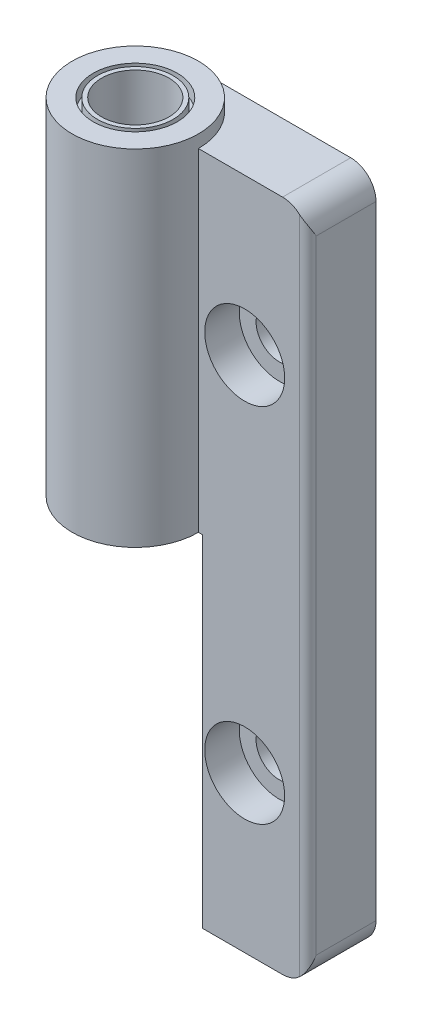
ISO-10303-21;
HEADER;
FILE_DESCRIPTION(('STEP AP214'),'2;1');
FILE_NAME('part.step','',(''),(''),'','','');
FILE_SCHEMA(('AUTOMOTIVE_DESIGN { 1 0 10303 214 1 1 1 1 }'));
ENDSEC;
DATA;
#1=APPLICATION_CONTEXT('core data for automotive mechanical design processes');
#2=APPLICATION_PROTOCOL_DEFINITION('international standard','automotive_design',2000,#1);
#3=PRODUCT_CONTEXT('',#1,'mechanical');
#4=PRODUCT('Part','Part','',(#3));
#5=PRODUCT_RELATED_PRODUCT_CATEGORY('part','',(#4));
#6=PRODUCT_DEFINITION_FORMATION('','',#4);
#7=PRODUCT_DEFINITION_CONTEXT('part definition',#1,'design');
#8=PRODUCT_DEFINITION('design','',#6,#7);
#9=PRODUCT_DEFINITION_SHAPE('','',#8);
#10=(LENGTH_UNIT() NAMED_UNIT(*) SI_UNIT(.MILLI.,.METRE.));
#11=(NAMED_UNIT(*) PLANE_ANGLE_UNIT() SI_UNIT($,.RADIAN.));
#12=(NAMED_UNIT(*) SI_UNIT($,.STERADIAN.) SOLID_ANGLE_UNIT());
#13=UNCERTAINTY_MEASURE_WITH_UNIT(LENGTH_MEASURE(1.E-05),#10,'distance_accuracy_value','');
#14=(GEOMETRIC_REPRESENTATION_CONTEXT(3) GLOBAL_UNCERTAINTY_ASSIGNED_CONTEXT((#13)) GLOBAL_UNIT_ASSIGNED_CONTEXT((#10,
#11,#12)) REPRESENTATION_CONTEXT('',''));
#15=CARTESIAN_POINT('',(0.,0.,0.));
#16=DIRECTION('',(0.,0.,1.));
#17=DIRECTION('',(1.,0.,0.));
#18=AXIS2_PLACEMENT_3D('',#15,#16,#17);
#19=CARTESIAN_POINT('',(0.,40.,0.));
#20=DIRECTION('',(0.,1.,0.));
#21=DIRECTION('',(0.,0.,1.));
#22=AXIS2_PLACEMENT_3D('',#19,#20,#21);
#23=PLANE('',#22);
#24=CARTESIAN_POINT('',(0.,40.,0.));
#25=DIRECTION('',(0.,1.,0.));
#26=DIRECTION('',(0.,0.,1.));
#27=AXIS2_PLACEMENT_3D('',#24,#25,#26);
#28=CIRCLE('',#27,4.5);
#29=CARTESIAN_POINT('',(0.,40.,4.5));
#30=VERTEX_POINT('',#29);
#31=EDGE_CURVE('E20',#30,#30,#28,.T.);
#32=ORIENTED_EDGE('',*,*,#31,.F.);
#33=EDGE_LOOP('',(#32));
#34=FACE_BOUND('',#33,.T.);
#35=CARTESIAN_POINT('',(0.,40.,0.));
#36=DIRECTION('',(0.,1.,0.));
#37=DIRECTION('',(0.,0.,1.));
#38=AXIS2_PLACEMENT_3D('',#35,#36,#37);
#39=CIRCLE('',#38,5.);
#40=CARTESIAN_POINT('',(0.,40.,5.));
#41=VERTEX_POINT('',#40);
#42=EDGE_CURVE('E323',#41,#41,#39,.T.);
#43=ORIENTED_EDGE('',*,*,#42,.T.);
#44=EDGE_LOOP('',(#43));
#45=FACE_BOUND('',#44,.T.);
#46=ADVANCED_FACE('F17',(#34,#45),#23,.T.);
#47=CARTESIAN_POINT('',(0.,41.5,0.));
#48=DIRECTION('',(0.,1.,0.));
#49=DIRECTION('',(0.,0.,1.));
#50=AXIS2_PLACEMENT_3D('',#47,#48,#49);
#51=CYLINDRICAL_SURFACE('',#50,4.5);
#52=CARTESIAN_POINT('',(0.,41.5,0.));
#53=DIRECTION('',(0.,1.,0.));
#54=DIRECTION('',(0.,0.,1.));
#55=AXIS2_PLACEMENT_3D('',#52,#53,#54);
#56=CIRCLE('',#55,4.5);
#57=CARTESIAN_POINT('',(0.,41.5,4.5));
#58=VERTEX_POINT('',#57);
#59=EDGE_CURVE('E321',#58,#58,#56,.T.);
#60=ORIENTED_EDGE('',*,*,#59,.F.);
#61=EDGE_LOOP('',(#60));
#62=FACE_BOUND('',#61,.T.);
#63=ORIENTED_EDGE('',*,*,#31,.T.);
#64=EDGE_LOOP('',(#63));
#65=FACE_BOUND('',#64,.T.);
#66=ADVANCED_FACE('F330',(#62,#65),#51,.T.);
#67=CARTESIAN_POINT('',(0.,41.5,0.));
#68=DIRECTION('',(0.,1.,0.));
#69=DIRECTION('',(0.,0.,1.));
#70=AXIS2_PLACEMENT_3D('',#67,#68,#69);
#71=CYLINDRICAL_SURFACE('',#70,5.);
#72=CARTESIAN_POINT('',(0.,41.5,0.));
#73=DIRECTION('',(0.,1.,0.));
#74=DIRECTION('',(0.,0.,1.));
#75=AXIS2_PLACEMENT_3D('',#72,#73,#74);
#76=CIRCLE('',#75,5.);
#77=CARTESIAN_POINT('',(0.,41.5,5.));
#78=VERTEX_POINT('',#77);
#79=EDGE_CURVE('E318',#78,#78,#76,.F.);
#80=ORIENTED_EDGE('',*,*,#79,.F.);
#81=EDGE_LOOP('',(#80));
#82=FACE_BOUND('',#81,.T.);
#83=ORIENTED_EDGE('',*,*,#42,.F.);
#84=EDGE_LOOP('',(#83));
#85=FACE_BOUND('',#84,.T.);
#86=ADVANCED_FACE('F336',(#82,#85),#71,.F.);
#87=CARTESIAN_POINT('',(3.75,41.5,0.));
#88=DIRECTION('',(0.,1.,0.));
#89=DIRECTION('',(0.,0.,1.));
#90=AXIS2_PLACEMENT_3D('',#87,#88,#89);
#91=PLANE('',#90);
#92=CARTESIAN_POINT('',(0.,41.5,0.));
#93=DIRECTION('',(0.,-1.,0.));
#94=DIRECTION('',(0.,0.,-1.));
#95=AXIS2_PLACEMENT_3D('',#92,#93,#94);
#96=CIRCLE('',#95,4.);
#97=CARTESIAN_POINT('',(0.,41.5,-4.));
#98=VERTEX_POINT('',#97);
#99=EDGE_CURVE('E306',#98,#98,#96,.T.);
#100=ORIENTED_EDGE('',*,*,#99,.T.);
#101=EDGE_LOOP('',(#100));
#102=FACE_BOUND('',#101,.T.);
#103=ORIENTED_EDGE('',*,*,#59,.T.);
#104=EDGE_LOOP('',(#103));
#105=FACE_BOUND('',#104,.T.);
#106=ADVANCED_FACE('F341',(#102,#105),#91,.T.);
#107=CARTESIAN_POINT('',(3.75,41.5,0.));
#108=DIRECTION('',(0.,1.,0.));
#109=DIRECTION('',(0.,0.,1.));
#110=AXIS2_PLACEMENT_3D('',#107,#108,#109);
#111=PLANE('',#110);
#112=CARTESIAN_POINT('',(0.,41.5,0.));
#113=DIRECTION('',(0.,-1.,0.));
#114=DIRECTION('',(0.,0.,-1.));
#115=AXIS2_PLACEMENT_3D('',#112,#113,#114);
#116=CIRCLE('',#115,7.5);
#117=CARTESIAN_POINT('',(0.,41.5,-7.5));
#118=VERTEX_POINT('',#117);
#119=EDGE_CURVE('E134',#118,#118,#116,.T.);
#120=ORIENTED_EDGE('',*,*,#119,.F.);
#121=EDGE_LOOP('',(#120));
#122=FACE_BOUND('',#121,.T.);
#123=ORIENTED_EDGE('',*,*,#79,.T.);
#124=EDGE_LOOP('',(#123));
#125=FACE_BOUND('',#124,.T.);
#126=ADVANCED_FACE('F348',(#122,#125),#111,.T.);
#127=CARTESIAN_POINT('',(13.,21.5,-2.05));
#128=DIRECTION('',(0.,0.,1.));
#129=DIRECTION('',(1.,0.,0.));
#130=AXIS2_PLACEMENT_3D('',#127,#128,#129);
#131=CYLINDRICAL_SURFACE('',#130,4.75);
#132=CARTESIAN_POINT('',(13.,21.5,0.));
#133=DIRECTION('',(0.,0.,1.));
#134=DIRECTION('',(1.,0.,0.));
#135=AXIS2_PLACEMENT_3D('',#132,#133,#134);
#136=CIRCLE('',#135,4.75);
#137=CARTESIAN_POINT('',(17.75,21.5,0.));
#138=VERTEX_POINT('',#137);
#139=EDGE_CURVE('E146',#138,#138,#136,.F.);
#140=ORIENTED_EDGE('',*,*,#139,.F.);
#141=EDGE_LOOP('',(#140));
#142=FACE_BOUND('',#141,.T.);
#143=CARTESIAN_POINT('',(13.,21.5,-4.1));
#144=DIRECTION('',(0.,0.,1.));
#145=DIRECTION('',(1.,0.,0.));
#146=AXIS2_PLACEMENT_3D('',#143,#144,#145);
#147=CIRCLE('',#146,4.75);
#148=CARTESIAN_POINT('',(17.75,21.5,-4.1));
#149=VERTEX_POINT('',#148);
#150=EDGE_CURVE('E312',#149,#149,#147,.F.);
#151=ORIENTED_EDGE('',*,*,#150,.T.);
#152=EDGE_LOOP('',(#151));
#153=FACE_BOUND('',#152,.T.);
#154=ADVANCED_FACE('F351',(#142,#153),#131,.F.);
#155=CARTESIAN_POINT('',(13.,-21.5,-2.05));
#156=DIRECTION('',(0.,0.,1.));
#157=DIRECTION('',(1.,0.,0.));
#158=AXIS2_PLACEMENT_3D('',#155,#156,#157);
#159=CYLINDRICAL_SURFACE('',#158,4.75);
#160=CARTESIAN_POINT('',(13.,-21.5,0.));
#161=DIRECTION('',(0.,0.,1.));
#162=DIRECTION('',(1.,0.,0.));
#163=AXIS2_PLACEMENT_3D('',#160,#161,#162);
#164=CIRCLE('',#163,4.75);
#165=CARTESIAN_POINT('',(17.75,-21.5,0.));
#166=VERTEX_POINT('',#165);
#167=EDGE_CURVE('E371',#166,#166,#164,.F.);
#168=ORIENTED_EDGE('',*,*,#167,.F.);
#169=EDGE_LOOP('',(#168));
#170=FACE_BOUND('',#169,.T.);
#171=CARTESIAN_POINT('',(13.,-21.5,-4.1));
#172=DIRECTION('',(0.,0.,1.));
#173=DIRECTION('',(1.,0.,0.));
#174=AXIS2_PLACEMENT_3D('',#171,#172,#173);
#175=CIRCLE('',#174,4.75);
#176=CARTESIAN_POINT('',(17.75,-21.5,-4.1));
#177=VERTEX_POINT('',#176);
#178=EDGE_CURVE('E308',#177,#177,#175,.F.);
#179=ORIENTED_EDGE('',*,*,#178,.T.);
#180=EDGE_LOOP('',(#179));
#181=FACE_BOUND('',#180,.T.);
#182=ADVANCED_FACE('F355',(#170,#181),#159,.F.);
#183=CARTESIAN_POINT('',(16.75,21.5,-4.1));
#184=DIRECTION('',(0.,0.,-1.));
#185=DIRECTION('',(-1.,0.,0.));
#186=AXIS2_PLACEMENT_3D('',#183,#184,#185);
#187=PLANE('',#186);
#188=ORIENTED_EDGE('',*,*,#150,.F.);
#189=EDGE_LOOP('',(#188));
#190=FACE_BOUND('',#189,.T.);
#191=CARTESIAN_POINT('',(13.,21.5,-4.1));
#192=DIRECTION('',(0.,0.,1.));
#193=DIRECTION('',(1.,0.,0.));
#194=AXIS2_PLACEMENT_3D('',#191,#192,#193);
#195=CIRCLE('',#194,2.75);
#196=CARTESIAN_POINT('',(15.75,21.5,-4.1));
#197=VERTEX_POINT('',#196);
#198=EDGE_CURVE('E370',#197,#197,#195,.F.);
#199=ORIENTED_EDGE('',*,*,#198,.T.);
#200=EDGE_LOOP('',(#199));
#201=FACE_BOUND('',#200,.T.);
#202=ADVANCED_FACE('F358',(#190,#201),#187,.F.);
#203=CARTESIAN_POINT('',(16.75,-21.5,-4.1));
#204=DIRECTION('',(0.,0.,-1.));
#205=DIRECTION('',(-1.,0.,0.));
#206=AXIS2_PLACEMENT_3D('',#203,#204,#205);
#207=PLANE('',#206);
#208=ORIENTED_EDGE('',*,*,#178,.F.);
#209=EDGE_LOOP('',(#208));
#210=FACE_BOUND('',#209,.T.);
#211=CARTESIAN_POINT('',(13.,-21.5,-4.1));
#212=DIRECTION('',(0.,0.,1.));
#213=DIRECTION('',(1.,0.,0.));
#214=AXIS2_PLACEMENT_3D('',#211,#212,#213);
#215=CIRCLE('',#214,2.75);
#216=CARTESIAN_POINT('',(15.75,-21.5,-4.1));
#217=VERTEX_POINT('',#216);
#218=EDGE_CURVE('E136',#217,#217,#215,.F.);
#219=ORIENTED_EDGE('',*,*,#218,.T.);
#220=EDGE_LOOP('',(#219));
#221=FACE_BOUND('',#220,.T.);
#222=ADVANCED_FACE('F198',(#210,#221),#207,.F.);
#223=CARTESIAN_POINT('',(19.5,50.,-1.));
#224=DIRECTION('',(0.,1.,0.));
#225=DIRECTION('',(0.,0.,1.));
#226=AXIS2_PLACEMENT_3D('',#223,#224,#225);
#227=CYLINDRICAL_SURFACE('',#226,1.);
#228=CARTESIAN_POINT('',(20.5,-37.,-1.));
#229=CARTESIAN_POINT('',(20.5,-37.0000000000765,-0.99999881498135));
#230=CARTESIAN_POINT('',(20.4999999999971,-37.0000001558719,-0.99999762997286));
#231=CARTESIAN_POINT('',(20.4999999999873,-37.0000006902982,-0.999995307974162));
#232=CARTESIAN_POINT('',(20.4999999999803,-37.0000010707991,-0.999994171473741));
#233=CARTESIAN_POINT('',(20.4999999999631,-37.0000020036007,-0.999991922753053));
#234=CARTESIAN_POINT('',(20.4999999999528,-37.0000025618171,-0.999990813047963));
#235=CARTESIAN_POINT('',(20.4999999999299,-37.000003798644,-0.999988668708707));
#236=CARTESIAN_POINT('',(20.4999999999174,-37.0000044769745,-0.999987633907745));
#237=CARTESIAN_POINT('',(20.4999999998742,-37.0000068131738,-0.999984357427274));
#238=CARTESIAN_POINT('',(20.4999999998405,-37.0000086324419,-0.999982230055543));
#239=CARTESIAN_POINT('',(20.4999999997684,-37.0000125035492,-0.999978273530908));
#240=CARTESIAN_POINT('',(20.4999999997301,-37.0000145516947,-0.999976440552064));
#241=CARTESIAN_POINT('',(20.4999999995887,-37.000022087061,-0.999970074617125));
#242=CARTESIAN_POINT('',(20.4999999994789,-37.0000278664591,-0.999965880651228));
#243=CARTESIAN_POINT('',(20.4999999992516,-37.0000396283378,-0.999958556733324));
#244=CARTESIAN_POINT('',(20.4999999991349,-37.0000455849203,-0.99995538302044));
#245=CARTESIAN_POINT('',(20.499999998659,-37.000069516742,-0.999942902357474));
#246=CARTESIAN_POINT('',(20.4999999982824,-37.0000877047298,-0.999934022803494));
#247=CARTESIAN_POINT('',(20.499999997292,-37.0001225943795,-0.999918824675468));
#248=CARTESIAN_POINT('',(20.4999999967118,-37.0001392161303,-0.999912327211288));
#249=CARTESIAN_POINT('',(20.4999999916734,-37.0002531777788,-0.999863916117624));
#250=CARTESIAN_POINT('',(20.4999999822364,-37.0003427665779,-0.999805907440112));
#251=CARTESIAN_POINT('',(20.499999931569,-37.0006819600869,-0.999595141533801));
#252=CARTESIAN_POINT('',(20.4999998636022,-37.0009370405746,-0.999454357337511));
#253=CARTESIAN_POINT('',(20.499999486522,-37.0018948838823,-0.998916919619629));
#254=CARTESIAN_POINT('',(20.4999989635144,-37.002592012909,-0.998507848939634));
#255=CARTESIAN_POINT('',(20.4999959296519,-37.0053509831666,-0.996897766759907));
#256=CARTESIAN_POINT('',(20.4999915313974,-37.0074189854615,-0.995710450704256));
#257=CARTESIAN_POINT('',(20.4998258924116,-37.0598601671228,-0.965591000464378));
#258=CARTESIAN_POINT('',(20.4984009030084,-37.1101451664202,-0.936451546131677));
#259=CARTESIAN_POINT('',(20.4930980879177,-37.2091393276714,-0.879341436691174));
#260=CARTESIAN_POINT('',(20.4892983045759,-37.2578486283314,-0.851362713008558));
#261=CARTESIAN_POINT('',(20.4788028084253,-37.3600458975993,-0.792848784059502));
#262=CARTESIAN_POINT('',(20.4718548172514,-37.4135230464823,-0.762338693486627));
#263=CARTESIAN_POINT('',(20.4549583752626,-37.5207604097342,-0.701572679033478));
#264=CARTESIAN_POINT('',(20.4449849057096,-37.5745191627797,-0.671321124436097));
#265=CARTESIAN_POINT('',(20.4245296356325,-37.6700462859901,-0.618070156958731));
#266=CARTESIAN_POINT('',(20.4146367520438,-37.7118639913997,-0.594932503822702));
#267=CARTESIAN_POINT('',(20.3930044984368,-37.7952203171253,-0.54924443508505));
#268=CARTESIAN_POINT('',(20.3812689901263,-37.8367593357993,-0.526692903801784));
#269=CARTESIAN_POINT('',(20.3436905852662,-37.9595085708775,-0.460823656813098));
#270=CARTESIAN_POINT('',(20.3151433666416,-38.0404099042454,-0.418416215760613));
#271=CARTESIAN_POINT('',(20.2604344512842,-38.1762628910604,-0.349589623256161));
#272=CARTESIAN_POINT('',(20.2362334909657,-38.231552238468,-0.322260615442504));
#273=CARTESIAN_POINT('',(20.1839917249138,-38.3416089839279,-0.269563130132801));
#274=CARTESIAN_POINT('',(20.1559346203182,-38.3963730504959,-0.244203730477434));
#275=CARTESIAN_POINT('',(20.0947065809691,-38.5072064031708,-0.195059521423501));
#276=CARTESIAN_POINT('',(20.0613706537559,-38.5632342570355,-0.171385182206121));
#277=CARTESIAN_POINT('',(19.9904804635481,-38.6738632536824,-0.127553610293863));
#278=CARTESIAN_POINT('',(19.9529321875464,-38.7284662887522,-0.107391487259184));
#279=CARTESIAN_POINT('',(19.8565874666359,-38.8589183790716,-0.0636670414843625));
#280=CARTESIAN_POINT('',(19.795555958446,-38.9339031108703,-0.0423184384680003));
#281=CARTESIAN_POINT('',(19.6656851197524,-39.0782446657922,-0.0115938656954792));
#282=CARTESIAN_POINT('',(19.5969328600011,-39.1476515801899,-0.00209661964174841));
#283=CARTESIAN_POINT('',(19.4707845141893,-39.2630475755536,0.00103213430059903));
#284=CARTESIAN_POINT('',(19.4148651466727,-39.3105439689993,-0.00195447637861609));
#285=CARTESIAN_POINT('',(19.3005290913988,-39.4007027488808,-0.0183992032299274));
#286=CARTESIAN_POINT('',(19.2421113715165,-39.4433631103493,-0.0318616874922086));
#287=CARTESIAN_POINT('',(19.1351160741429,-39.5159184792531,-0.0675426067985735));
#288=CARTESIAN_POINT('',(19.0865531345612,-39.5467508527781,-0.0878845424501594));
#289=CARTESIAN_POINT('',(18.9912134374369,-39.6037202846015,-0.137436469116288));
#290=CARTESIAN_POINT('',(18.9444354936501,-39.6298605054868,-0.166640450976771));
#291=CARTESIAN_POINT('',(18.8545919680174,-39.6772522126014,-0.234089392066142));
#292=CARTESIAN_POINT('',(18.8115479552824,-39.6984763433567,-0.272382648332966));
#293=CARTESIAN_POINT('',(18.7317717736512,-39.735815216142,-0.357185817655621));
#294=CARTESIAN_POINT('',(18.6950383852326,-39.7519309458757,-0.403694139626079));
#295=CARTESIAN_POINT('',(18.6330595181398,-39.7779850075778,-0.498683346748921));
#296=CARTESIAN_POINT('',(18.6070496164375,-39.7883679296213,-0.546545953505008));
#297=CARTESIAN_POINT('',(18.5630076783685,-39.8054546756688,-0.646416440944699));
#298=CARTESIAN_POINT('',(18.5449737649666,-39.8121593653817,-0.698423342923909));
#299=CARTESIAN_POINT('',(18.5181431869427,-39.8219819740968,-0.803091198932771));
#300=CARTESIAN_POINT('',(18.5090402739593,-39.825219185657,-0.855662815968091));
#301=CARTESIAN_POINT('',(18.4993179368042,-39.828673040143,-0.961681816056418));
#302=CARTESIAN_POINT('',(18.498697997978,-39.8288898663128,-1.01512914578375));
#303=CARTESIAN_POINT('',(18.5059488517363,-39.8263193265105,-1.12112745474809));
#304=CARTESIAN_POINT('',(18.5137813149569,-39.8235455222924,-1.17368139178125));
#305=CARTESIAN_POINT('',(18.5375769005558,-39.8148877242653,-1.27664648410098));
#306=CARTESIAN_POINT('',(18.5535396750883,-39.8090038635161,-1.32705773096011));
#307=CARTESIAN_POINT('',(18.5929752993486,-39.7938948025735,-1.42433647991449));
#308=CARTESIAN_POINT('',(18.6164509238138,-39.7846683676934,-1.47120266478508));
#309=CARTESIAN_POINT('',(18.669947558898,-39.7626176341964,-1.56009255965431));
#310=CARTESIAN_POINT('',(18.6999681582138,-39.74979356165,-1.6021165736941));
#311=CARTESIAN_POINT('',(18.7656031941911,-39.7202117340709,-1.68066514935614));
#312=CARTESIAN_POINT('',(18.8012669599202,-39.7034185762242,-1.71713505255204));
#313=CARTESIAN_POINT('',(18.8764793448096,-39.6659086381735,-1.78341323632875));
#314=CARTESIAN_POINT('',(18.9160280638061,-39.6451917571242,-1.81322134564924));
#315=CARTESIAN_POINT('',(18.9993828605709,-39.5988890446745,-1.86715711029148));
#316=CARTESIAN_POINT('',(19.0433016778418,-39.573120099576,-1.89095183182012));
#317=CARTESIAN_POINT('',(19.1320944120729,-39.5177403079705,-1.93114267763173));
#318=CARTESIAN_POINT('',(19.17696914348,-39.4881260660613,-1.94753220513373));
#319=CARTESIAN_POINT('',(19.2835352276131,-39.4134385427058,-1.97841265907635));
#320=CARTESIAN_POINT('',(19.3450511946278,-39.3668023684033,-1.98974473718382));
#321=CARTESIAN_POINT('',(19.4647513501964,-39.268432745266,-2.00119095354081));
#322=CARTESIAN_POINT('',(19.5229360456642,-39.2167000752332,-2.00130680310301));
#323=CARTESIAN_POINT('',(19.6559761066003,-39.0888251700667,-1.99078924243564));
#324=CARTESIAN_POINT('',(19.7287587102352,-39.0108806080343,-1.9760521253171));
#325=CARTESIAN_POINT('',(19.8649340883143,-38.8489107671206,-1.93379863459049));
#326=CARTESIAN_POINT('',(19.928195996277,-38.7648208798751,-1.90612247765479));
#327=CARTESIAN_POINT('',(20.0298773953477,-38.6142554932404,-1.84954433424995));
#328=CARTESIAN_POINT('',(20.0705789988397,-38.548538526966,-1.82262055661356));
#329=CARTESIAN_POINT('',(20.1462035363651,-38.4154419046754,-1.76465392252112));
#330=CARTESIAN_POINT('',(20.181115660823,-38.3480594024519,-1.73360355165372));
#331=CARTESIAN_POINT('',(20.2436242140927,-38.215573092584,-1.6700066749176));
#332=CARTESIAN_POINT('',(20.2715009719946,-38.1505259588913,-1.63761481366912));
#333=CARTESIAN_POINT('',(20.3221385698925,-38.0200032000194,-1.57081932468059));
#334=CARTESIAN_POINT('',(20.3449271222905,-37.9545319992234,-1.53642794774312));
#335=CARTESIAN_POINT('',(20.3851012555693,-37.8250126763729,-1.46706763274144));
#336=CARTESIAN_POINT('',(20.4026309520968,-37.7609823920886,-1.43214865311916));
#337=CARTESIAN_POINT('',(20.4257841904622,-37.6640177393983,-1.37856560366788));
#338=CARTESIAN_POINT('',(20.4330315931466,-37.6312276938411,-1.36032501707769));
#339=CARTESIAN_POINT('',(20.44641280022,-37.5654901636329,-1.32355273053342));
#340=CARTESIAN_POINT('',(20.4525442561091,-37.5325424933556,-1.30502050381773));
#341=CARTESIAN_POINT('',(20.4653041931434,-37.4569847913224,-1.26233250169268));
#342=CARTESIAN_POINT('',(20.4715590125745,-37.4143502003937,-1.23810805266644));
#343=CARTESIAN_POINT('',(20.4821708452238,-37.3293573372717,-1.18960645695241));
#344=CARTESIAN_POINT('',(20.486543440924,-37.2869997725754,-1.16533148334596));
#345=CARTESIAN_POINT('',(20.4931635438982,-37.2060718395917,-1.11886012116172));
#346=CARTESIAN_POINT('',(20.4955680891007,-37.16750719977,-1.09667536399259));
#347=CARTESIAN_POINT('',(20.4989402421663,-37.0891474046522,-1.05143540687725));
#348=CARTESIAN_POINT('',(20.4998590785587,-37.0493526191732,-1.02837518386015));
#349=CARTESIAN_POINT('',(20.4999915294882,-37.0074196333772,-1.00428986096506));
#350=CARTESIAN_POINT('',(20.4999959270021,-37.0053522369509,-1.00310294290191));
#351=CARTESIAN_POINT('',(20.4999989623935,-37.0025934301573,-1.00149296997108));
#352=CARTESIAN_POINT('',(20.4999994860218,-37.0018958491183,-1.00108363083085));
#353=CARTESIAN_POINT('',(20.4999998634962,-37.0009374142662,-1.00054586197135));
#354=CARTESIAN_POINT('',(20.4999999315245,-37.0006821989324,-1.00040500376237));
#355=CARTESIAN_POINT('',(20.4999999822285,-37.0003428457008,-1.0001941370376));
#356=CARTESIAN_POINT('',(20.4999999916706,-37.0002532286004,-1.00013610991168));
#357=CARTESIAN_POINT('',(20.499999996711,-37.0001392323897,-1.00008768745095));
#358=CARTESIAN_POINT('',(20.4999999972914,-37.0001226078194,-1.00008118935247));
#359=CARTESIAN_POINT('',(20.499999998282,-37.0000877122825,-1.00006598877421));
#360=CARTESIAN_POINT('',(20.4999999986588,-37.0000695212937,-1.00005710724877));
#361=CARTESIAN_POINT('',(20.4999999991347,-37.0000455860864,-1.00004462387152));
#362=CARTESIAN_POINT('',(20.4999999992515,-37.0000396289858,-1.00004144962687));
#363=CARTESIAN_POINT('',(20.4999999994788,-37.0000278661821,-1.00003412439573));
#364=CARTESIAN_POINT('',(20.4999999995886,-37.0000220863885,-1.00002992963336));
#365=CARTESIAN_POINT('',(20.4999999997301,-37.000014550674,-1.00002356254707));
#366=CARTESIAN_POINT('',(20.4999999997683,-37.0000125024825,-1.00002172927253));
#367=CARTESIAN_POINT('',(20.4999999998404,-37.0000086313451,-1.0000177721215));
#368=CARTESIAN_POINT('',(20.4999999998742,-37.0000068120939,-1.00001564441833));
#369=CARTESIAN_POINT('',(20.4999999999174,-37.0000044759908,-1.00001236746171));
#370=CARTESIAN_POINT('',(20.4999999999299,-37.0000037977026,-1.00001133252049));
#371=CARTESIAN_POINT('',(20.4999999999528,-37.0000025609845,-1.00000918790103));
#372=CARTESIAN_POINT('',(20.4999999999631,-37.0000020028347,-1.00000807805596));
#373=CARTESIAN_POINT('',(20.4999999999803,-37.0000010701956,-1.00000582907098));
#374=CARTESIAN_POINT('',(20.4999999999873,-37.000000689789,-1.0000046924462));
#375=CARTESIAN_POINT('',(20.4999999999971,-37.0000001555882,-1.00000237021775));
#376=CARTESIAN_POINT('',(20.5,-36.9999999999235,-1.00000118510379));
#377=CARTESIAN_POINT('',(20.5,-37.,-1.));
#378=B_SPLINE_CURVE_WITH_KNOTS('',3,(#228,#229,#230,#231,#232,#233,#234,#235,#236,#237,#238,
#239,#240,#241,#242,#243,#244,#245,#246,#247,#248,#249,#250,#251,#252,#253,#254,#255,#256,#257,
#258,#259,#260,#261,#262,#263,#264,#265,#266,#267,#268,#269,#270,#271,#272,#273,#274,#275,#276,
#277,#278,#279,#280,#281,#282,#283,#284,#285,#286,#287,#288,#289,#290,#291,#292,#293,#294,#295,
#296,#297,#298,#299,#300,#301,#302,#303,#304,#305,#306,#307,#308,#309,#310,#311,#312,#313,#314,
#315,#316,#317,#318,#319,#320,#321,#322,#323,#324,#325,#326,#327,#328,#329,#330,#331,#332,#333,
#334,#335,#336,#337,#338,#339,#340,#341,#342,#343,#344,#345,#346,#347,#348,#349,#350,#351,#352,
#353,#354,#355,#356,#357,#358,#359,#360,#361,#362,#363,#364,#365,#366,#367,#368,#369,#370,#371,
#372,#373,#374,#375,#376,#377),.UNSPECIFIED.,.T.,.F.,(4,2,2,2,2,2,2,2,2,2,2,2,2,2,2,2,2,2,2,2,2,
2,2,2,2,2,2,2,2,2,2,2,2,2,2,2,2,2,2,2,2,2,2,2,2,2,2,2,2,2,2,2,2,2,2,2,2,2,2,2,2,2,2,2,2,2,2,2,2,
2,2,2,2,2,4),(0.,3.55130444821736E-06,7.13258708645834E-06,1.08483791583423E-05,
1.4555624762586E-05,2.29130708175777E-05,3.11511308688826E-05,5.24824391963125E-05,
7.27122256572961E-05,0.000133398560251326,0.000186879821426277,0.000505113403974747,
0.00138064174742194,0.00380371758318192,0.0109592854047864,0.185270364778973,0.354134248948165,
0.539938568245008,0.727323308763445,0.873699430877757,1.0197727800288,1.30647943779291,
1.50511898327258,1.70462553798798,1.9124899954804,2.12006267214776,2.4161104564781,
2.70910322278553,2.92860978357251,3.14820792035652,3.33049213061613,3.51265301320861,
3.69580439936494,3.87892035176901,4.0444522749033,4.20994522170726,4.36954125556576,
4.52912760683428,4.68799330631384,4.84685220947877,5.00576985218955,5.1646775109767,
5.32505994588097,5.48544650339669,5.65337323974832,5.8214492770182,6.05421779145867,
6.28695079125738,6.60817085383652,6.93346688234418,7.17870054942582,7.42438706064322,
7.65767151697577,7.88965261647122,8.11452797403069,8.22916008298719,8.34403071295602,
8.49229420287186,8.63930547608839,8.77295372097179,8.91090619159147,8.91805959755818,
8.92048424799685,8.92136023918958,8.92167857302638,8.92173206282583,8.92179275977559,
8.92181299167649,8.92183432531012,8.92184256406245,8.92185092222082,8.92185462974782,
8.92185834582296,8.92186192736691,8.92186547892652),.UNSPECIFIED.);
#379=CARTESIAN_POINT('',(20.5,-37.,-1.));
#380=VERTEX_POINT('',#379);
#381=CARTESIAN_POINT('',(19.5,-39.2360679774998,0.));
#382=VERTEX_POINT('',#381);
#383=EDGE_CURVE('E105',#380,#382,#378,.T.);
#384=ORIENTED_EDGE('',*,*,#383,.F.);
#385=DIRECTION('',(0.,1.,0.));
#386=VECTOR('',#385,1.);
#387=CARTESIAN_POINT('',(20.5,37.,-1.));
#388=LINE('',#387,#386);
#389=CARTESIAN_POINT('',(20.5,37.,-1.));
#390=VERTEX_POINT('',#389);
#391=EDGE_CURVE('E91',#390,#380,#388,.F.);
#392=ORIENTED_EDGE('',*,*,#391,.F.);
#393=CARTESIAN_POINT('',(19.5,39.2360679774998,0.));
#394=CARTESIAN_POINT('',(19.5316578772173,39.2077572937075,-4.55551071989541E-06));
#395=CARTESIAN_POINT('',(19.562687444377,39.1787885816354,-0.00150263052096969));
#396=CARTESIAN_POINT('',(19.6233321725057,39.1197274162069,-0.00716698518481731));
#397=CARTESIAN_POINT('',(19.652949081136,39.0896364379924,-0.0113298709753123));
#398=CARTESIAN_POINT('',(19.7391262742663,38.9983201473494,-0.0272642318094623));
#399=CARTESIAN_POINT('',(19.7934948471067,38.935618835025,-0.0424913092058012));
#400=CARTESIAN_POINT('',(19.9295613572291,38.7651445015374,-0.0924370178179898));
#401=CARTESIAN_POINT('',(20.0057446330972,38.6548259454961,-0.133388824712246));
#402=CARTESIAN_POINT('',(20.1412372779232,38.4287723628818,-0.228187305913884));
#403=CARTESIAN_POINT('',(20.2004379140891,38.3130077259145,-0.282113178334025));
#404=CARTESIAN_POINT('',(20.2876689239468,38.1122851667142,-0.381459073324625));
#405=CARTESIAN_POINT('',(20.319766680889,38.0280484674357,-0.424861251473683));
#406=CARTESIAN_POINT('',(20.3759320021476,37.8584871191475,-0.514664336115285));
#407=CARTESIAN_POINT('',(20.3999955148087,37.7731619436708,-0.561066741580453));
#408=CARTESIAN_POINT('',(20.460402907647,37.5165620419738,-0.703036580570069));
#409=CARTESIAN_POINT('',(20.4852102334562,37.3440816395096,-0.801666019614406));
#410=CARTESIAN_POINT('',(20.4981840462985,37.1175431072325,-0.932142301887701));
#411=CARTESIAN_POINT('',(20.4998141662827,37.0635187811286,-0.963327735185313));
#412=CARTESIAN_POINT('',(20.4999949980915,37.0063245855028,-0.996348494144039));
#413=CARTESIAN_POINT('',(20.4999999978197,37.0031623061903,-0.998174236846674));
#414=CARTESIAN_POINT('',(20.5,37.,-1.));
#415=B_SPLINE_CURVE_WITH_KNOTS('',3,(#393,#394,#395,#396,#397,#398,#399,#400,#401,#402,#403,
#404,#405,#406,#407,#408,#409,#410,#411,#412,#413,#414),.UNSPECIFIED.,.F.,.F.,(4,2,2,2,2,2,2,2,
2,2,4),(0.,0.127328124372213,0.254494407314625,0.506902758847989,0.925154347494113,
1.34602692875661,1.64578712718783,1.94569826663477,2.54344782717991,2.73062158792371,
2.74157604934412),.UNSPECIFIED.);
#416=CARTESIAN_POINT('',(19.5,39.2360679774998,0.));
#417=VERTEX_POINT('',#416);
#418=EDGE_CURVE('E117',#417,#390,#415,.T.);
#419=ORIENTED_EDGE('',*,*,#418,.F.);
#420=DIRECTION('',(0.,1.,0.));
#421=VECTOR('',#420,1.);
#422=CARTESIAN_POINT('',(19.5,0.,0.));
#423=LINE('',#422,#421);
#424=EDGE_CURVE('E107',#382,#417,#423,.T.);
#425=ORIENTED_EDGE('',*,*,#424,.F.);
#426=EDGE_LOOP('',(#384,#392,#419,#425));
#427=FACE_BOUND('',#426,.T.);
#428=ADVANCED_FACE('F106',(#427),#227,.T.);
#429=CARTESIAN_POINT('',(0.,0.,0.));
#430=DIRECTION('',(0.,-1.,0.));
#431=DIRECTION('',(0.,0.,-1.));
#432=AXIS2_PLACEMENT_3D('',#429,#430,#431);
#433=CYLINDRICAL_SURFACE('',#432,4.);
#434=CARTESIAN_POINT('',(0.,0.5,0.));
#435=DIRECTION('',(0.,-1.,0.));
#436=DIRECTION('',(0.,0.,-1.));
#437=AXIS2_PLACEMENT_3D('',#434,#435,#436);
#438=CIRCLE('',#437,4.);
#439=CARTESIAN_POINT('',(0.,0.5,-4.));
#440=VERTEX_POINT('',#439);
#441=EDGE_CURVE('E175',#440,#440,#438,.T.);
#442=ORIENTED_EDGE('',*,*,#441,.T.);
#443=EDGE_LOOP('',(#442));
#444=FACE_BOUND('',#443,.T.);
#445=ORIENTED_EDGE('',*,*,#99,.F.);
#446=EDGE_LOOP('',(#445));
#447=FACE_BOUND('',#446,.T.);
#448=ADVANCED_FACE('F197',(#444,#447),#433,.F.);
#449=CARTESIAN_POINT('',(0.,0.,0.));
#450=DIRECTION('',(0.,-1.,0.));
#451=DIRECTION('',(0.,0.,-1.));
#452=AXIS2_PLACEMENT_3D('',#449,#450,#451);
#453=CYLINDRICAL_SURFACE('',#452,7.5);
#454=ORIENTED_EDGE('',*,*,#119,.T.);
#455=EDGE_LOOP('',(#454));
#456=FACE_BOUND('',#455,.T.);
#457=CARTESIAN_POINT('',(0.,0.5,0.));
#458=DIRECTION('',(0.,-1.,0.));
#459=DIRECTION('',(0.,0.,-1.));
#460=AXIS2_PLACEMENT_3D('',#457,#458,#459);
#461=CIRCLE('',#460,7.5);
#462=CARTESIAN_POINT('',(2.,0.5,-7.22841614740048));
#463=VERTEX_POINT('',#462);
#464=CARTESIAN_POINT('',(7.5,0.5,0.));
#465=VERTEX_POINT('',#464);
#466=EDGE_CURVE('E171',#463,#465,#461,.F.);
#467=ORIENTED_EDGE('',*,*,#466,.T.);
#468=DIRECTION('',(0.,1.,0.));
#469=VECTOR('',#468,1.);
#470=CARTESIAN_POINT('',(7.5,0.,0.));
#471=LINE('',#470,#469);
#472=CARTESIAN_POINT('',(7.5,40.,0.));
#473=VERTEX_POINT('',#472);
#474=EDGE_CURVE('E133',#473,#465,#471,.F.);
#475=ORIENTED_EDGE('',*,*,#474,.F.);
#476=CARTESIAN_POINT('',(0.,40.,0.));
#477=DIRECTION('',(0.,-1.,0.));
#478=DIRECTION('',(0.,0.,-1.));
#479=AXIS2_PLACEMENT_3D('',#476,#477,#478);
#480=CIRCLE('',#479,7.5);
#481=CARTESIAN_POINT('',(2.,40.,-7.22841614740048));
#482=VERTEX_POINT('',#481);
#483=EDGE_CURVE('E178',#482,#473,#480,.T.);
#484=ORIENTED_EDGE('',*,*,#483,.F.);
#485=DIRECTION('',(0.,1.,0.));
#486=VECTOR('',#485,1.);
#487=CARTESIAN_POINT('',(2.,-40.,-7.22841614740048));
#488=LINE('',#487,#486);
#489=EDGE_CURVE('E150',#463,#482,#488,.T.);
#490=ORIENTED_EDGE('',*,*,#489,.F.);
#491=EDGE_LOOP('',(#467,#475,#484,#490));
#492=FACE_BOUND('',#491,.T.);
#493=ADVANCED_FACE('F225',(#456,#492),#453,.T.);
#494=CARTESIAN_POINT('',(0.,0.,0.));
#495=DIRECTION('',(0.,0.,1.));
#496=DIRECTION('',(1.,0.,0.));
#497=AXIS2_PLACEMENT_3D('',#494,#495,#496);
#498=PLANE('',#497);
#499=ORIENTED_EDGE('',*,*,#167,.T.);
#500=EDGE_LOOP('',(#499));
#501=FACE_BOUND('',#500,.T.);
#502=ORIENTED_EDGE('',*,*,#139,.T.);
#503=EDGE_LOOP('',(#502));
#504=FACE_BOUND('',#503,.T.);
#505=DIRECTION('',(1.,0.,0.));
#506=VECTOR('',#505,1.);
#507=CARTESIAN_POINT('',(17.5,-40.,0.));
#508=LINE('',#507,#506);
#509=CARTESIAN_POINT('',(17.5,-40.,0.));
#510=VERTEX_POINT('',#509);
#511=CARTESIAN_POINT('',(8.,-40.,0.));
#512=VERTEX_POINT('',#511);
#513=EDGE_CURVE('E111',#510,#512,#508,.F.);
#514=ORIENTED_EDGE('',*,*,#513,.F.);
#515=CARTESIAN_POINT('',(17.5,-37.,0.));
#516=DIRECTION('',(0.,0.,-1.));
#517=DIRECTION('',(-1.,0.,0.));
#518=AXIS2_PLACEMENT_3D('',#515,#516,#517);
#519=CIRCLE('',#518,2.99999999999999);
#520=EDGE_CURVE('E110',#382,#510,#519,.T.);
#521=ORIENTED_EDGE('',*,*,#520,.F.);
#522=ORIENTED_EDGE('',*,*,#424,.T.);
#523=CARTESIAN_POINT('',(17.5,37.,0.));
#524=DIRECTION('',(0.,0.,-1.));
#525=DIRECTION('',(-1.,0.,0.));
#526=AXIS2_PLACEMENT_3D('',#523,#524,#525);
#527=CIRCLE('',#526,3.);
#528=CARTESIAN_POINT('',(17.5,40.,0.));
#529=VERTEX_POINT('',#528);
#530=EDGE_CURVE('E181',#529,#417,#527,.T.);
#531=ORIENTED_EDGE('',*,*,#530,.F.);
#532=DIRECTION('',(1.,0.,0.));
#533=VECTOR('',#532,1.);
#534=CARTESIAN_POINT('',(2.,40.,0.));
#535=LINE('',#534,#533);
#536=EDGE_CURVE('E180',#473,#529,#535,.T.);
#537=ORIENTED_EDGE('',*,*,#536,.F.);
#538=ORIENTED_EDGE('',*,*,#474,.T.);
#539=DIRECTION('',(1.,0.,0.));
#540=VECTOR('',#539,1.);
#541=CARTESIAN_POINT('',(8.,0.5,0.));
#542=LINE('',#541,#540);
#543=CARTESIAN_POINT('',(8.,0.5,0.));
#544=VERTEX_POINT('',#543);
#545=EDGE_CURVE('E127',#465,#544,#542,.T.);
#546=ORIENTED_EDGE('',*,*,#545,.T.);
#547=DIRECTION('',(0.,1.,0.));
#548=VECTOR('',#547,1.);
#549=CARTESIAN_POINT('',(8.,-41.5,0.));
#550=LINE('',#549,#548);
#551=EDGE_CURVE('E139',#544,#512,#550,.F.);
#552=ORIENTED_EDGE('',*,*,#551,.T.);
#553=EDGE_LOOP('',(#514,#521,#522,#531,#537,#538,#546,#552));
#554=FACE_BOUND('',#553,.T.);
#555=ADVANCED_FACE('F222',(#501,#504,#554),#498,.T.);
#556=CARTESIAN_POINT('',(13.,21.5,-6.1));
#557=DIRECTION('',(0.,0.,1.));
#558=DIRECTION('',(1.,0.,0.));
#559=AXIS2_PLACEMENT_3D('',#556,#557,#558);
#560=CYLINDRICAL_SURFACE('',#559,2.75);
#561=ORIENTED_EDGE('',*,*,#198,.F.);
#562=EDGE_LOOP('',(#561));
#563=FACE_BOUND('',#562,.T.);
#564=CARTESIAN_POINT('',(13.,21.5,-8.1));
#565=DIRECTION('',(0.,0.,1.));
#566=DIRECTION('',(1.,0.,0.));
#567=AXIS2_PLACEMENT_3D('',#564,#565,#566);
#568=CIRCLE('',#567,2.75);
#569=CARTESIAN_POINT('',(15.75,21.5,-8.1));
#570=VERTEX_POINT('',#569);
#571=EDGE_CURVE('E142',#570,#570,#568,.F.);
#572=ORIENTED_EDGE('',*,*,#571,.T.);
#573=EDGE_LOOP('',(#572));
#574=FACE_BOUND('',#573,.T.);
#575=ADVANCED_FACE('F218',(#563,#574),#560,.F.);
#576=CARTESIAN_POINT('',(13.,-21.5,-6.1));
#577=DIRECTION('',(0.,0.,1.));
#578=DIRECTION('',(1.,0.,0.));
#579=AXIS2_PLACEMENT_3D('',#576,#577,#578);
#580=CYLINDRICAL_SURFACE('',#579,2.75);
#581=ORIENTED_EDGE('',*,*,#218,.F.);
#582=EDGE_LOOP('',(#581));
#583=FACE_BOUND('',#582,.T.);
#584=CARTESIAN_POINT('',(13.,-21.5,-8.1));
#585=DIRECTION('',(0.,0.,1.));
#586=DIRECTION('',(1.,0.,0.));
#587=AXIS2_PLACEMENT_3D('',#584,#585,#586);
#588=CIRCLE('',#587,2.75);
#589=CARTESIAN_POINT('',(15.75,-21.5,-8.1));
#590=VERTEX_POINT('',#589);
#591=EDGE_CURVE('E166',#590,#590,#588,.F.);
#592=ORIENTED_EDGE('',*,*,#591,.T.);
#593=EDGE_LOOP('',(#592));
#594=FACE_BOUND('',#593,.T.);
#595=ADVANCED_FACE('F214',(#583,#594),#580,.F.);
#596=CARTESIAN_POINT('',(17.5,-40.,-8.1));
#597=DIRECTION('',(0.,-1.,0.));
#598=DIRECTION('',(0.,0.,-1.));
#599=AXIS2_PLACEMENT_3D('',#596,#597,#598);
#600=PLANE('',#599);
#601=DIRECTION('',(0.,0.,-1.));
#602=VECTOR('',#601,1.);
#603=CARTESIAN_POINT('',(17.5,-40.,-8.1));
#604=LINE('',#603,#602);
#605=CARTESIAN_POINT('',(17.5,-40.,-8.1));
#606=VERTEX_POINT('',#605);
#607=EDGE_CURVE('E101',#510,#606,#604,.T.);
#608=ORIENTED_EDGE('',*,*,#607,.F.);
#609=ORIENTED_EDGE('',*,*,#513,.T.);
#610=DIRECTION('',(0.,0.,-1.));
#611=VECTOR('',#610,1.);
#612=CARTESIAN_POINT('',(8.,-40.,11.9));
#613=LINE('',#612,#611);
#614=CARTESIAN_POINT('',(8.,-40.,-8.1));
#615=VERTEX_POINT('',#614);
#616=EDGE_CURVE('E124',#512,#615,#613,.T.);
#617=ORIENTED_EDGE('',*,*,#616,.T.);
#618=DIRECTION('',(1.,0.,0.));
#619=VECTOR('',#618,1.);
#620=CARTESIAN_POINT('',(0.,-40.,-8.1));
#621=LINE('',#620,#619);
#622=EDGE_CURVE('E165',#615,#606,#621,.T.);
#623=ORIENTED_EDGE('',*,*,#622,.T.);
#624=EDGE_LOOP('',(#608,#609,#617,#623));
#625=FACE_BOUND('',#624,.T.);
#626=ADVANCED_FACE('F211',(#625),#600,.T.);
#627=CARTESIAN_POINT('',(17.5,-37.,-8.1));
#628=DIRECTION('',(0.,0.,-1.));
#629=DIRECTION('',(-1.,0.,0.));
#630=AXIS2_PLACEMENT_3D('',#627,#628,#629);
#631=CYLINDRICAL_SURFACE('',#630,2.99999999999999);
#632=CARTESIAN_POINT('',(17.5,-37.,-8.1));
#633=DIRECTION('',(0.,0.,-1.));
#634=DIRECTION('',(-1.,0.,0.));
#635=AXIS2_PLACEMENT_3D('',#632,#633,#634);
#636=CIRCLE('',#635,2.99999999999999);
#637=CARTESIAN_POINT('',(20.5,-37.,-8.1));
#638=VERTEX_POINT('',#637);
#639=EDGE_CURVE('E116',#606,#638,#636,.F.);
#640=ORIENTED_EDGE('',*,*,#639,.T.);
#641=DIRECTION('',(0.,0.,-1.));
#642=VECTOR('',#641,1.);
#643=CARTESIAN_POINT('',(20.5,-37.,-8.1));
#644=LINE('',#643,#642);
#645=EDGE_CURVE('E96',#380,#638,#644,.T.);
#646=ORIENTED_EDGE('',*,*,#645,.F.);
#647=ORIENTED_EDGE('',*,*,#383,.T.);
#648=ORIENTED_EDGE('',*,*,#520,.T.);
#649=ORIENTED_EDGE('',*,*,#607,.T.);
#650=EDGE_LOOP('',(#640,#646,#647,#648,#649));
#651=FACE_BOUND('',#650,.T.);
#652=ADVANCED_FACE('F114',(#651),#631,.T.);
#653=CARTESIAN_POINT('',(20.5,37.,-8.1));
#654=DIRECTION('',(1.,0.,0.));
#655=DIRECTION('',(0.,0.,-1.));
#656=AXIS2_PLACEMENT_3D('',#653,#654,#655);
#657=PLANE('',#656);
#658=DIRECTION('',(0.,1.,0.));
#659=VECTOR('',#658,1.);
#660=CARTESIAN_POINT('',(20.5,0.,-8.1));
#661=LINE('',#660,#659);
#662=CARTESIAN_POINT('',(20.5,37.,-8.1));
#663=VERTEX_POINT('',#662);
#664=EDGE_CURVE('E163',#638,#663,#661,.T.);
#665=ORIENTED_EDGE('',*,*,#664,.T.);
#666=DIRECTION('',(0.,0.,-1.));
#667=VECTOR('',#666,1.);
#668=CARTESIAN_POINT('',(20.5,37.,-8.1));
#669=LINE('',#668,#667);
#670=EDGE_CURVE('E98',#390,#663,#669,.T.);
#671=ORIENTED_EDGE('',*,*,#670,.F.);
#672=ORIENTED_EDGE('',*,*,#391,.T.);
#673=ORIENTED_EDGE('',*,*,#645,.T.);
#674=EDGE_LOOP('',(#665,#671,#672,#673));
#675=FACE_BOUND('',#674,.T.);
#676=ADVANCED_FACE('F94',(#675),#657,.T.);
#677=CARTESIAN_POINT('',(17.5,37.,-8.1));
#678=DIRECTION('',(0.,0.,-1.));
#679=DIRECTION('',(-1.,0.,0.));
#680=AXIS2_PLACEMENT_3D('',#677,#678,#679);
#681=CYLINDRICAL_SURFACE('',#680,3.);
#682=DIRECTION('',(0.,0.,1.));
#683=VECTOR('',#682,1.);
#684=CARTESIAN_POINT('',(17.5,40.,-8.1));
#685=LINE('',#684,#683);
#686=CARTESIAN_POINT('',(17.5,40.,-8.1));
#687=VERTEX_POINT('',#686);
#688=EDGE_CURVE('E153',#529,#687,#685,.F.);
#689=ORIENTED_EDGE('',*,*,#688,.F.);
#690=ORIENTED_EDGE('',*,*,#530,.T.);
#691=ORIENTED_EDGE('',*,*,#418,.T.);
#692=ORIENTED_EDGE('',*,*,#670,.T.);
#693=CARTESIAN_POINT('',(17.5,37.,-8.1));
#694=DIRECTION('',(0.,0.,-1.));
#695=DIRECTION('',(-1.,0.,0.));
#696=AXIS2_PLACEMENT_3D('',#693,#694,#695);
#697=CIRCLE('',#696,3.);
#698=EDGE_CURVE('E159',#663,#687,#697,.F.);
#699=ORIENTED_EDGE('',*,*,#698,.T.);
#700=EDGE_LOOP('',(#689,#690,#691,#692,#699));
#701=FACE_BOUND('',#700,.T.);
#702=ADVANCED_FACE('F189',(#701),#681,.T.);
#703=CARTESIAN_POINT('',(2.,40.,-8.1));
#704=DIRECTION('',(0.,1.,0.));
#705=DIRECTION('',(0.,0.,1.));
#706=AXIS2_PLACEMENT_3D('',#703,#704,#705);
#707=PLANE('',#706);
#708=DIRECTION('',(1.,0.,0.));
#709=VECTOR('',#708,1.);
#710=CARTESIAN_POINT('',(0.,40.,-8.1));
#711=LINE('',#710,#709);
#712=CARTESIAN_POINT('',(2.,40.,-8.1));
#713=VERTEX_POINT('',#712);
#714=EDGE_CURVE('E162',#687,#713,#711,.F.);
#715=ORIENTED_EDGE('',*,*,#714,.T.);
#716=DIRECTION('',(0.,0.,1.));
#717=VECTOR('',#716,1.);
#718=CARTESIAN_POINT('',(2.,40.,-8.1));
#719=LINE('',#718,#717);
#720=EDGE_CURVE('E152',#482,#713,#719,.F.);
#721=ORIENTED_EDGE('',*,*,#720,.F.);
#722=ORIENTED_EDGE('',*,*,#483,.T.);
#723=ORIENTED_EDGE('',*,*,#536,.T.);
#724=ORIENTED_EDGE('',*,*,#688,.T.);
#725=EDGE_LOOP('',(#715,#721,#722,#723,#724));
#726=FACE_BOUND('',#725,.T.);
#727=ADVANCED_FACE('F254',(#726),#707,.T.);
#728=CARTESIAN_POINT('',(2.,-40.,-8.1));
#729=DIRECTION('',(-1.,0.,0.));
#730=DIRECTION('',(0.,0.,1.));
#731=AXIS2_PLACEMENT_3D('',#728,#729,#730);
#732=PLANE('',#731);
#733=ORIENTED_EDGE('',*,*,#720,.T.);
#734=DIRECTION('',(0.,1.,0.));
#735=VECTOR('',#734,1.);
#736=CARTESIAN_POINT('',(2.,0.,-8.1));
#737=LINE('',#736,#735);
#738=CARTESIAN_POINT('',(2.,0.5,-8.1));
#739=VERTEX_POINT('',#738);
#740=EDGE_CURVE('E156',#713,#739,#737,.F.);
#741=ORIENTED_EDGE('',*,*,#740,.T.);
#742=DIRECTION('',(0.,0.,1.));
#743=VECTOR('',#742,1.);
#744=CARTESIAN_POINT('',(2.,0.5,11.9));
#745=LINE('',#744,#743);
#746=EDGE_CURVE('E174',#739,#463,#745,.T.);
#747=ORIENTED_EDGE('',*,*,#746,.T.);
#748=ORIENTED_EDGE('',*,*,#489,.T.);
#749=EDGE_LOOP('',(#733,#741,#747,#748));
#750=FACE_BOUND('',#749,.T.);
#751=ADVANCED_FACE('F251',(#750),#732,.T.);
#752=CARTESIAN_POINT('',(8.,0.5,11.9));
#753=DIRECTION('',(0.,1.,0.));
#754=DIRECTION('',(0.,0.,1.));
#755=AXIS2_PLACEMENT_3D('',#752,#753,#754);
#756=PLANE('',#755);
#757=ORIENTED_EDGE('',*,*,#466,.F.);
#758=ORIENTED_EDGE('',*,*,#746,.F.);
#759=DIRECTION('',(1.,0.,0.));
#760=VECTOR('',#759,1.);
#761=CARTESIAN_POINT('',(0.,0.5,-8.1));
#762=LINE('',#761,#760);
#763=CARTESIAN_POINT('',(8.,0.5,-8.1));
#764=VERTEX_POINT('',#763);
#765=EDGE_CURVE('E26',#739,#764,#762,.T.);
#766=ORIENTED_EDGE('',*,*,#765,.T.);
#767=DIRECTION('',(0.,0.,-1.));
#768=VECTOR('',#767,1.);
#769=CARTESIAN_POINT('',(8.,0.5,11.9));
#770=LINE('',#769,#768);
#771=EDGE_CURVE('E34',#764,#544,#770,.F.);
#772=ORIENTED_EDGE('',*,*,#771,.T.);
#773=ORIENTED_EDGE('',*,*,#545,.F.);
#774=EDGE_LOOP('',(#757,#758,#766,#772,#773));
#775=FACE_BOUND('',#774,.T.);
#776=ORIENTED_EDGE('',*,*,#441,.F.);
#777=EDGE_LOOP('',(#776));
#778=FACE_BOUND('',#777,.T.);
#779=ADVANCED_FACE('F244',(#775,#778),#756,.F.);
#780=CARTESIAN_POINT('',(8.,-41.5,11.9));
#781=DIRECTION('',(1.,0.,0.));
#782=DIRECTION('',(0.,0.,-1.));
#783=AXIS2_PLACEMENT_3D('',#780,#781,#782);
#784=PLANE('',#783);
#785=ORIENTED_EDGE('',*,*,#771,.F.);
#786=DIRECTION('',(0.,1.,0.));
#787=VECTOR('',#786,1.);
#788=CARTESIAN_POINT('',(8.,0.,-8.1));
#789=LINE('',#788,#787);
#790=EDGE_CURVE('E11',#764,#615,#789,.F.);
#791=ORIENTED_EDGE('',*,*,#790,.T.);
#792=ORIENTED_EDGE('',*,*,#616,.F.);
#793=ORIENTED_EDGE('',*,*,#551,.F.);
#794=EDGE_LOOP('',(#785,#791,#792,#793));
#795=FACE_BOUND('',#794,.T.);
#796=ADVANCED_FACE('F238',(#795),#784,.F.);
#797=CARTESIAN_POINT('',(0.,0.,-8.1));
#798=DIRECTION('',(0.,0.,1.));
#799=DIRECTION('',(1.,0.,0.));
#800=AXIS2_PLACEMENT_3D('',#797,#798,#799);
#801=PLANE('',#800);
#802=ORIENTED_EDGE('',*,*,#765,.F.);
#803=ORIENTED_EDGE('',*,*,#740,.F.);
#804=ORIENTED_EDGE('',*,*,#714,.F.);
#805=ORIENTED_EDGE('',*,*,#698,.F.);
#806=ORIENTED_EDGE('',*,*,#664,.F.);
#807=ORIENTED_EDGE('',*,*,#639,.F.);
#808=ORIENTED_EDGE('',*,*,#622,.F.);
#809=ORIENTED_EDGE('',*,*,#790,.F.);
#810=EDGE_LOOP('',(#802,#803,#804,#805,#806,#807,#808,#809));
#811=FACE_BOUND('',#810,.T.);
#812=ORIENTED_EDGE('',*,*,#591,.F.);
#813=EDGE_LOOP('',(#812));
#814=FACE_BOUND('',#813,.T.);
#815=ORIENTED_EDGE('',*,*,#571,.F.);
#816=EDGE_LOOP('',(#815));
#817=FACE_BOUND('',#816,.T.);
#818=ADVANCED_FACE('F236',(#811,#814,#817),#801,.F.);
#819=CLOSED_SHELL('',(#46,#66,#86,#106,#126,#154,#182,#202,#222,#428,#448,#493,#555,#575,#595,
#626,#652,#676,#702,#727,#751,#779,#796,#818));
#820=MANIFOLD_SOLID_BREP('B1',#819);
#821=ADVANCED_BREP_SHAPE_REPRESENTATION('',(#18,#820),#14);
#822=SHAPE_DEFINITION_REPRESENTATION(#9,#821);
ENDSEC;
END-ISO-10303-21;
